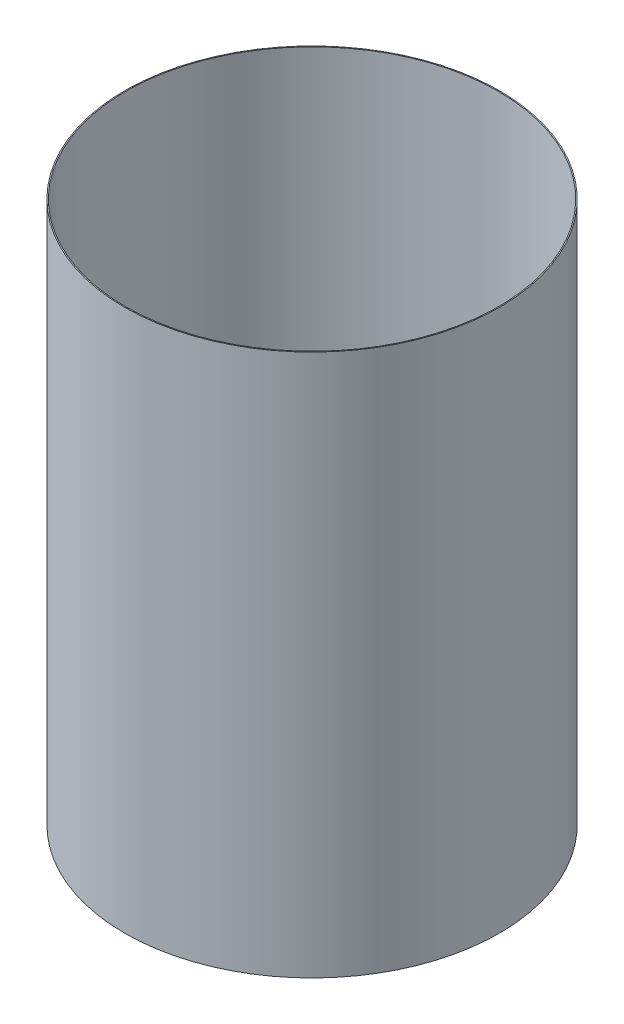
ISO-10303-21;
HEADER;
FILE_DESCRIPTION(('STEP AP214'),'2;1');
FILE_NAME('part.step','',(''),(''),'','','');
FILE_SCHEMA(('AUTOMOTIVE_DESIGN { 1 0 10303 214 1 1 1 1 }'));
ENDSEC;
DATA;
#1=APPLICATION_CONTEXT('core data for automotive mechanical design processes');
#2=APPLICATION_PROTOCOL_DEFINITION('international standard','automotive_design',2000,#1);
#3=PRODUCT_CONTEXT('',#1,'mechanical');
#4=PRODUCT('Part','Part','',(#3));
#5=PRODUCT_RELATED_PRODUCT_CATEGORY('part','',(#4));
#6=PRODUCT_DEFINITION_FORMATION('','',#4);
#7=PRODUCT_DEFINITION_CONTEXT('part definition',#1,'design');
#8=PRODUCT_DEFINITION('design','',#6,#7);
#9=PRODUCT_DEFINITION_SHAPE('','',#8);
#10=(LENGTH_UNIT() NAMED_UNIT(*) SI_UNIT(.MILLI.,.METRE.));
#11=(NAMED_UNIT(*) PLANE_ANGLE_UNIT() SI_UNIT($,.RADIAN.));
#12=(NAMED_UNIT(*) SI_UNIT($,.STERADIAN.) SOLID_ANGLE_UNIT());
#13=UNCERTAINTY_MEASURE_WITH_UNIT(LENGTH_MEASURE(1.E-05),#10,'distance_accuracy_value','');
#14=(GEOMETRIC_REPRESENTATION_CONTEXT(3) GLOBAL_UNCERTAINTY_ASSIGNED_CONTEXT((#13)) GLOBAL_UNIT_ASSIGNED_CONTEXT((#10,
#11,#12)) REPRESENTATION_CONTEXT('',''));
#15=CARTESIAN_POINT('',(0.,0.,0.));
#16=DIRECTION('',(0.,0.,1.));
#17=DIRECTION('',(1.,0.,0.));
#18=AXIS2_PLACEMENT_3D('',#15,#16,#17);
#19=CARTESIAN_POINT('',(0.,55.,0.));
#20=DIRECTION('',(0.,1.,0.));
#21=DIRECTION('',(0.,0.,1.));
#22=AXIS2_PLACEMENT_3D('',#19,#20,#21);
#23=CYLINDRICAL_SURFACE('',#22,46.1264);
#24=CARTESIAN_POINT('',(0.,-153.255914232196,0.));
#25=DIRECTION('',(0.,1.,0.));
#26=DIRECTION('',(0.,0.,1.));
#27=AXIS2_PLACEMENT_3D('',#24,#25,#26);
#28=CIRCLE('',#27,46.1264);
#29=CARTESIAN_POINT('',(0.,-153.255914232196,46.1264));
#30=VERTEX_POINT('',#29);
#31=EDGE_CURVE('E44',#30,#30,#28,.T.);
#32=ORIENTED_EDGE('',*,*,#31,.T.);
#33=EDGE_LOOP('',(#32));
#34=FACE_BOUND('',#33,.T.);
#35=CARTESIAN_POINT('',(0.,-19.905914232196,0.));
#36=DIRECTION('',(0.,1.,0.));
#37=DIRECTION('',(0.,0.,1.));
#38=AXIS2_PLACEMENT_3D('',#35,#36,#37);
#39=CIRCLE('',#38,46.1264);
#40=CARTESIAN_POINT('',(0.,-19.905914232196,46.1264));
#41=VERTEX_POINT('',#40);
#42=EDGE_CURVE('E10',#41,#41,#39,.T.);
#43=ORIENTED_EDGE('',*,*,#42,.F.);
#44=EDGE_LOOP('',(#43));
#45=FACE_BOUND('',#44,.T.);
#46=ADVANCED_FACE('F30',(#34,#45),#23,.T.);
#47=CARTESIAN_POINT('',(-46.1264,-19.905914232196,0.));
#48=DIRECTION('',(0.,-1.,0.));
#49=DIRECTION('',(0.,0.,-1.));
#50=AXIS2_PLACEMENT_3D('',#47,#48,#49);
#51=PLANE('',#50);
#52=CARTESIAN_POINT('',(0.,-19.905914232196,0.));
#53=DIRECTION('',(0.,1.,0.));
#54=DIRECTION('',(0.,0.,1.));
#55=AXIS2_PLACEMENT_3D('',#52,#53,#54);
#56=CIRCLE('',#55,45.8724);
#57=CARTESIAN_POINT('',(0.,-19.905914232196,45.8724));
#58=VERTEX_POINT('',#57);
#59=EDGE_CURVE('E36',#58,#58,#56,.T.);
#60=ORIENTED_EDGE('',*,*,#59,.F.);
#61=EDGE_LOOP('',(#60));
#62=FACE_BOUND('',#61,.T.);
#63=ORIENTED_EDGE('',*,*,#42,.T.);
#64=EDGE_LOOP('',(#63));
#65=FACE_BOUND('',#64,.T.);
#66=ADVANCED_FACE('F60',(#62,#65),#51,.F.);
#67=CARTESIAN_POINT('',(0.,55.,0.));
#68=DIRECTION('',(0.,1.,0.));
#69=DIRECTION('',(0.,0.,1.));
#70=AXIS2_PLACEMENT_3D('',#67,#68,#69);
#71=CYLINDRICAL_SURFACE('',#70,45.8724);
#72=CARTESIAN_POINT('',(0.,-153.255914232196,0.));
#73=DIRECTION('',(0.,1.,0.));
#74=DIRECTION('',(0.,0.,1.));
#75=AXIS2_PLACEMENT_3D('',#72,#73,#74);
#76=CIRCLE('',#75,45.8724);
#77=CARTESIAN_POINT('',(0.,-153.255914232196,45.8724));
#78=VERTEX_POINT('',#77);
#79=EDGE_CURVE('E40',#78,#78,#76,.T.);
#80=ORIENTED_EDGE('',*,*,#79,.F.);
#81=EDGE_LOOP('',(#80));
#82=FACE_BOUND('',#81,.T.);
#83=ORIENTED_EDGE('',*,*,#59,.T.);
#84=EDGE_LOOP('',(#83));
#85=FACE_BOUND('',#84,.T.);
#86=ADVANCED_FACE('F55',(#82,#85),#71,.F.);
#87=CARTESIAN_POINT('',(-45.8724,-153.255914232196,0.));
#88=DIRECTION('',(0.,1.,0.));
#89=DIRECTION('',(0.,0.,1.));
#90=AXIS2_PLACEMENT_3D('',#87,#88,#89);
#91=PLANE('',#90);
#92=ORIENTED_EDGE('',*,*,#31,.F.);
#93=EDGE_LOOP('',(#92));
#94=FACE_BOUND('',#93,.T.);
#95=ORIENTED_EDGE('',*,*,#79,.T.);
#96=EDGE_LOOP('',(#95));
#97=FACE_BOUND('',#96,.T.);
#98=ADVANCED_FACE('F52',(#94,#97),#91,.F.);
#99=CLOSED_SHELL('',(#46,#66,#86,#98));
#100=MANIFOLD_SOLID_BREP('B2',#99);
#101=ADVANCED_BREP_SHAPE_REPRESENTATION('',(#18,#100),#14);
#102=SHAPE_DEFINITION_REPRESENTATION(#9,#101);
ENDSEC;
END-ISO-10303-21;
